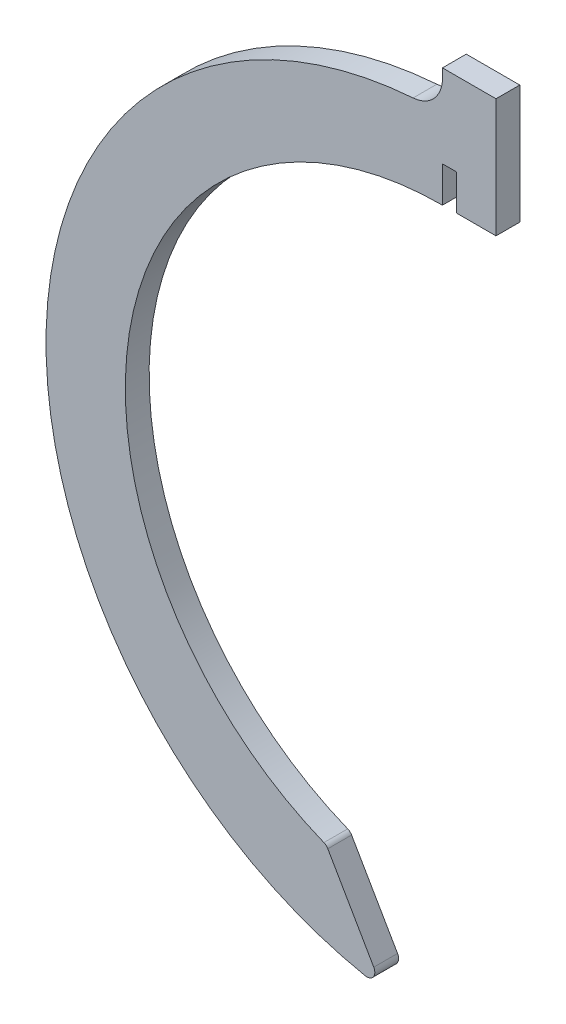
ISO-10303-21;
HEADER;
FILE_DESCRIPTION(('STEP AP214'),'2;1');
FILE_NAME('part.step','',(''),(''),'','','');
FILE_SCHEMA(('AUTOMOTIVE_DESIGN { 1 0 10303 214 1 1 1 1 }'));
ENDSEC;
DATA;
#1=APPLICATION_CONTEXT('core data for automotive mechanical design processes');
#2=APPLICATION_PROTOCOL_DEFINITION('international standard','automotive_design',2000,#1);
#3=PRODUCT_CONTEXT('',#1,'mechanical');
#4=PRODUCT('Part','Part','',(#3));
#5=PRODUCT_RELATED_PRODUCT_CATEGORY('part','',(#4));
#6=PRODUCT_DEFINITION_FORMATION('','',#4);
#7=PRODUCT_DEFINITION_CONTEXT('part definition',#1,'design');
#8=PRODUCT_DEFINITION('design','',#6,#7);
#9=PRODUCT_DEFINITION_SHAPE('','',#8);
#10=(LENGTH_UNIT() NAMED_UNIT(*) SI_UNIT(.MILLI.,.METRE.));
#11=(NAMED_UNIT(*) PLANE_ANGLE_UNIT() SI_UNIT($,.RADIAN.));
#12=(NAMED_UNIT(*) SI_UNIT($,.STERADIAN.) SOLID_ANGLE_UNIT());
#13=UNCERTAINTY_MEASURE_WITH_UNIT(LENGTH_MEASURE(1.E-05),#10,'distance_accuracy_value','');
#14=(GEOMETRIC_REPRESENTATION_CONTEXT(3) GLOBAL_UNCERTAINTY_ASSIGNED_CONTEXT((#13)) GLOBAL_UNIT_ASSIGNED_CONTEXT((#10,
#11,#12)) REPRESENTATION_CONTEXT('',''));
#15=CARTESIAN_POINT('',(0.,0.,0.));
#16=DIRECTION('',(0.,0.,1.));
#17=DIRECTION('',(1.,0.,0.));
#18=AXIS2_PLACEMENT_3D('',#15,#16,#17);
#19=CARTESIAN_POINT('',(0.,0.,3.));
#20=DIRECTION('',(-1.,0.,0.));
#21=DIRECTION('',(0.,0.,1.));
#22=AXIS2_PLACEMENT_3D('',#19,#20,#21);
#23=PLANE('',#22);
#24=DIRECTION('',(0.,1.,0.));
#25=VECTOR('',#24,1.);
#26=CARTESIAN_POINT('',(0.,0.,0.));
#27=LINE('',#26,#25);
#28=CARTESIAN_POINT('',(0.,53.8516480713451,0.));
#29=VERTEX_POINT('',#28);
#30=CARTESIAN_POINT('',(0.,55.,0.));
#31=VERTEX_POINT('',#30);
#32=EDGE_CURVE('E174',#29,#31,#27,.T.);
#33=ORIENTED_EDGE('',*,*,#32,.F.);
#34=DIRECTION('',(0.,0.,-1.));
#35=VECTOR('',#34,1.);
#36=CARTESIAN_POINT('',(0.,53.8516480713451,3.));
#37=LINE('',#36,#35);
#38=CARTESIAN_POINT('',(0.,53.8516480713451,3.));
#39=VERTEX_POINT('',#38);
#40=EDGE_CURVE('E53',#29,#39,#37,.F.);
#41=ORIENTED_EDGE('',*,*,#40,.T.);
#42=DIRECTION('',(0.,1.,0.));
#43=VECTOR('',#42,1.);
#44=CARTESIAN_POINT('',(0.,0.,3.));
#45=LINE('',#44,#43);
#46=CARTESIAN_POINT('',(0.,55.,3.));
#47=VERTEX_POINT('',#46);
#48=EDGE_CURVE('E195',#39,#47,#45,.T.);
#49=ORIENTED_EDGE('',*,*,#48,.T.);
#50=DIRECTION('',(0.,0.,-1.));
#51=VECTOR('',#50,1.);
#52=CARTESIAN_POINT('',(0.,55.,3.));
#53=LINE('',#52,#51);
#54=EDGE_CURVE('E173',#47,#31,#53,.T.);
#55=ORIENTED_EDGE('',*,*,#54,.T.);
#56=EDGE_LOOP('',(#33,#41,#49,#55));
#57=FACE_BOUND('',#56,.T.);
#58=ADVANCED_FACE('F38',(#57),#23,.T.);
#59=CARTESIAN_POINT('',(0.,0.,3.));
#60=DIRECTION('',(0.,0.,-1.));
#61=DIRECTION('',(-1.,0.,0.));
#62=AXIS2_PLACEMENT_3D('',#59,#60,#61);
#63=CYLINDRICAL_SURFACE('',#62,50.);
#64=CARTESIAN_POINT('',(0.,0.,3.));
#65=DIRECTION('',(0.,0.,1.));
#66=DIRECTION('',(1.,0.,0.));
#67=AXIS2_PLACEMENT_3D('',#64,#65,#66);
#68=CIRCLE('',#67,50.);
#69=CARTESIAN_POINT('',(-3.7037037037037,49.8626371030973,3.));
#70=VERTEX_POINT('',#69);
#71=CARTESIAN_POINT('',(-9.72775243810218,-49.0445800522647,3.));
#72=VERTEX_POINT('',#71);
#73=EDGE_CURVE('E159',#70,#72,#68,.T.);
#74=ORIENTED_EDGE('',*,*,#73,.F.);
#75=DIRECTION('',(0.,0.,-1.));
#76=VECTOR('',#75,1.);
#77=CARTESIAN_POINT('',(-3.7037037037037,49.8626371030973,3.));
#78=LINE('',#77,#76);
#79=CARTESIAN_POINT('',(-3.7037037037037,49.8626371030973,0.));
#80=VERTEX_POINT('',#79);
#81=EDGE_CURVE('E228',#70,#80,#78,.T.);
#82=ORIENTED_EDGE('',*,*,#81,.T.);
#83=CARTESIAN_POINT('',(0.,0.,0.));
#84=DIRECTION('',(0.,0.,1.));
#85=DIRECTION('',(1.,0.,0.));
#86=AXIS2_PLACEMENT_3D('',#83,#84,#85);
#87=CIRCLE('',#86,50.);
#88=CARTESIAN_POINT('',(-9.72775243810218,-49.0445800522647,0.));
#89=VERTEX_POINT('',#88);
#90=EDGE_CURVE('E176',#80,#89,#87,.T.);
#91=ORIENTED_EDGE('',*,*,#90,.T.);
#92=DIRECTION('',(0.,0.,-1.));
#93=VECTOR('',#92,1.);
#94=CARTESIAN_POINT('',(-9.72775243810218,-49.0445800522647,3.));
#95=LINE('',#94,#93);
#96=EDGE_CURVE('E215',#89,#72,#95,.F.);
#97=ORIENTED_EDGE('',*,*,#96,.T.);
#98=EDGE_LOOP('',(#74,#82,#91,#97));
#99=FACE_BOUND('',#98,.T.);
#100=ADVANCED_FACE('F234',(#99),#63,.T.);
#101=CARTESIAN_POINT('',(-27.0960602373891,-15.6439176720351,3.));
#102=DIRECTION('',(0.866025403784436,0.500000000000004,0.));
#103=DIRECTION('',(-0.500000000000004,0.866025403784437,0.));
#104=AXIS2_PLACEMENT_3D('',#101,#102,#103);
#105=PLANE('',#104);
#106=DIRECTION('',(0.500000000000004,-0.866025403784436,0.));
#107=VECTOR('',#106,1.);
#108=CARTESIAN_POINT('',(-27.0960602373891,-15.6439176720351,0.));
#109=LINE('',#108,#107);
#110=CARTESIAN_POINT('',(-14.4618241228248,-37.5270565372818,0.));
#111=VERTEX_POINT('',#110);
#112=CARTESIAN_POINT('',(-8.6671719855557,-47.5636884512194,0.));
#113=VERTEX_POINT('',#112);
#114=EDGE_CURVE('E178',#111,#113,#109,.T.);
#115=ORIENTED_EDGE('',*,*,#114,.F.);
#116=DIRECTION('',(0.,0.,-1.));
#117=VECTOR('',#116,1.);
#118=CARTESIAN_POINT('',(-14.4618241228248,-37.5270565372818,3.));
#119=LINE('',#118,#117);
#120=CARTESIAN_POINT('',(-14.4618241228248,-37.5270565372818,3.));
#121=VERTEX_POINT('',#120);
#122=EDGE_CURVE('E225',#111,#121,#119,.F.);
#123=ORIENTED_EDGE('',*,*,#122,.T.);
#124=DIRECTION('',(0.500000000000004,-0.866025403784436,0.));
#125=VECTOR('',#124,1.);
#126=CARTESIAN_POINT('',(-27.0960602373891,-15.6439176720351,3.));
#127=LINE('',#126,#125);
#128=CARTESIAN_POINT('',(-8.6671719855557,-47.5636884512194,3.));
#129=VERTEX_POINT('',#128);
#130=EDGE_CURVE('E157',#121,#129,#127,.T.);
#131=ORIENTED_EDGE('',*,*,#130,.T.);
#132=DIRECTION('',(0.,0.,1.));
#133=VECTOR('',#132,1.);
#134=CARTESIAN_POINT('',(-8.6671719855557,-47.5636884512194,0.));
#135=LINE('',#134,#133);
#136=EDGE_CURVE('E142',#129,#113,#135,.F.);
#137=ORIENTED_EDGE('',*,*,#136,.T.);
#138=EDGE_LOOP('',(#115,#123,#131,#137));
#139=FACE_BOUND('',#138,.T.);
#140=ADVANCED_FACE('F270',(#139),#105,.T.);
#141=CARTESIAN_POINT('',(0.,0.,3.));
#142=DIRECTION('',(0.,0.,-1.));
#143=DIRECTION('',(-1.,0.,0.));
#144=AXIS2_PLACEMENT_3D('',#141,#142,#143);
#145=CYLINDRICAL_SURFACE('',#144,40.);
#146=CARTESIAN_POINT('',(0.,0.,3.));
#147=DIRECTION('',(0.,0.,1.));
#148=DIRECTION('',(1.,0.,0.));
#149=AXIS2_PLACEMENT_3D('',#146,#147,#148);
#150=CIRCLE('',#149,40.);
#151=CARTESIAN_POINT('',(0.,40.,3.));
#152=VERTEX_POINT('',#151);
#153=CARTESIAN_POINT('',(-14.9539995381554,-37.0995673534456,3.));
#154=VERTEX_POINT('',#153);
#155=EDGE_CURVE('E136',#152,#154,#150,.T.);
#156=ORIENTED_EDGE('',*,*,#155,.T.);
#157=DIRECTION('',(0.,0.,-1.));
#158=VECTOR('',#157,1.);
#159=CARTESIAN_POINT('',(-14.9539995381554,-37.0995673534457,3.));
#160=LINE('',#159,#158);
#161=CARTESIAN_POINT('',(-14.9539995381554,-37.0995673534456,0.));
#162=VERTEX_POINT('',#161);
#163=EDGE_CURVE('E221',#154,#162,#160,.T.);
#164=ORIENTED_EDGE('',*,*,#163,.T.);
#165=CARTESIAN_POINT('',(0.,0.,0.));
#166=DIRECTION('',(0.,0.,1.));
#167=DIRECTION('',(1.,0.,0.));
#168=AXIS2_PLACEMENT_3D('',#165,#166,#167);
#169=CIRCLE('',#168,40.);
#170=CARTESIAN_POINT('',(0.,40.,0.));
#171=VERTEX_POINT('',#170);
#172=EDGE_CURVE('E139',#171,#162,#169,.T.);
#173=ORIENTED_EDGE('',*,*,#172,.F.);
#174=DIRECTION('',(0.,0.,-1.));
#175=VECTOR('',#174,1.);
#176=CARTESIAN_POINT('',(0.,40.,3.));
#177=LINE('',#176,#175);
#178=EDGE_CURVE('E131',#152,#171,#177,.T.);
#179=ORIENTED_EDGE('',*,*,#178,.F.);
#180=EDGE_LOOP('',(#156,#164,#173,#179));
#181=FACE_BOUND('',#180,.T.);
#182=ADVANCED_FACE('F133',(#181),#145,.F.);
#183=CARTESIAN_POINT('',(0.,0.,3.));
#184=DIRECTION('',(-1.,0.,0.));
#185=DIRECTION('',(0.,0.,1.));
#186=AXIS2_PLACEMENT_3D('',#183,#184,#185);
#187=PLANE('',#186);
#188=DIRECTION('',(0.,1.,0.));
#189=VECTOR('',#188,1.);
#190=CARTESIAN_POINT('',(0.,0.,0.));
#191=LINE('',#190,#189);
#192=CARTESIAN_POINT('',(0.,44.5184182434861,0.));
#193=VERTEX_POINT('',#192);
#194=EDGE_CURVE('E181',#171,#193,#191,.T.);
#195=ORIENTED_EDGE('',*,*,#194,.T.);
#196=DIRECTION('',(0.,0.,-1.));
#197=VECTOR('',#196,1.);
#198=CARTESIAN_POINT('',(0.,44.5184182434861,3.));
#199=LINE('',#198,#197);
#200=CARTESIAN_POINT('',(0.,44.5184182434861,3.));
#201=VERTEX_POINT('',#200);
#202=EDGE_CURVE('E143',#201,#193,#199,.T.);
#203=ORIENTED_EDGE('',*,*,#202,.F.);
#204=DIRECTION('',(0.,1.,0.));
#205=VECTOR('',#204,1.);
#206=CARTESIAN_POINT('',(0.,0.,3.));
#207=LINE('',#206,#205);
#208=EDGE_CURVE('E146',#152,#201,#207,.T.);
#209=ORIENTED_EDGE('',*,*,#208,.F.);
#210=ORIENTED_EDGE('',*,*,#178,.T.);
#211=EDGE_LOOP('',(#195,#203,#209,#210));
#212=FACE_BOUND('',#211,.T.);
#213=ADVANCED_FACE('F147',(#212),#187,.F.);
#214=CARTESIAN_POINT('',(0.,44.5184182434861,3.));
#215=DIRECTION('',(0.,1.,0.));
#216=DIRECTION('',(0.,0.,1.));
#217=AXIS2_PLACEMENT_3D('',#214,#215,#216);
#218=PLANE('',#217);
#219=DIRECTION('',(1.,0.,0.));
#220=VECTOR('',#219,1.);
#221=CARTESIAN_POINT('',(0.,44.5184182434861,0.));
#222=LINE('',#221,#220);
#223=CARTESIAN_POINT('',(1.79,44.5184182434861,0.));
#224=VERTEX_POINT('',#223);
#225=EDGE_CURVE('E183',#193,#224,#222,.T.);
#226=ORIENTED_EDGE('',*,*,#225,.T.);
#227=DIRECTION('',(0.,0.,-1.));
#228=VECTOR('',#227,1.);
#229=CARTESIAN_POINT('',(1.79,44.5184182434861,3.));
#230=LINE('',#229,#228);
#231=CARTESIAN_POINT('',(1.79,44.5184182434861,3.));
#232=VERTEX_POINT('',#231);
#233=EDGE_CURVE('E206',#232,#224,#230,.T.);
#234=ORIENTED_EDGE('',*,*,#233,.F.);
#235=DIRECTION('',(1.,0.,0.));
#236=VECTOR('',#235,1.);
#237=CARTESIAN_POINT('',(0.,44.5184182434861,3.));
#238=LINE('',#237,#236);
#239=EDGE_CURVE('E151',#201,#232,#238,.T.);
#240=ORIENTED_EDGE('',*,*,#239,.F.);
#241=ORIENTED_EDGE('',*,*,#202,.T.);
#242=EDGE_LOOP('',(#226,#234,#240,#241));
#243=FACE_BOUND('',#242,.T.);
#244=ADVANCED_FACE('F295',(#243),#218,.F.);
#245=CARTESIAN_POINT('',(1.79000000000001,0.,3.));
#246=DIRECTION('',(1.,0.,0.));
#247=DIRECTION('',(0.,1.,0.));
#248=AXIS2_PLACEMENT_3D('',#245,#246,#247);
#249=PLANE('',#248);
#250=DIRECTION('',(0.,-1.,0.));
#251=VECTOR('',#250,1.);
#252=CARTESIAN_POINT('',(1.79000000000001,0.,0.));
#253=LINE('',#252,#251);
#254=CARTESIAN_POINT('',(1.79,40.02,0.));
#255=VERTEX_POINT('',#254);
#256=EDGE_CURVE('E185',#224,#255,#253,.T.);
#257=ORIENTED_EDGE('',*,*,#256,.T.);
#258=DIRECTION('',(0.,0.,-1.));
#259=VECTOR('',#258,1.);
#260=CARTESIAN_POINT('',(1.79,40.02,3.));
#261=LINE('',#260,#259);
#262=CARTESIAN_POINT('',(1.79,40.02,3.));
#263=VERTEX_POINT('',#262);
#264=EDGE_CURVE('E203',#263,#255,#261,.T.);
#265=ORIENTED_EDGE('',*,*,#264,.F.);
#266=DIRECTION('',(0.,-1.,0.));
#267=VECTOR('',#266,1.);
#268=CARTESIAN_POINT('',(1.79000000000001,0.,3.));
#269=LINE('',#268,#267);
#270=EDGE_CURVE('E164',#232,#263,#269,.T.);
#271=ORIENTED_EDGE('',*,*,#270,.F.);
#272=ORIENTED_EDGE('',*,*,#233,.T.);
#273=EDGE_LOOP('',(#257,#265,#271,#272));
#274=FACE_BOUND('',#273,.T.);
#275=ADVANCED_FACE('F291',(#274),#249,.F.);
#276=CARTESIAN_POINT('',(0.,40.02,3.));
#277=DIRECTION('',(0.,1.,0.));
#278=DIRECTION('',(0.,0.,1.));
#279=AXIS2_PLACEMENT_3D('',#276,#277,#278);
#280=PLANE('',#279);
#281=DIRECTION('',(1.,0.,0.));
#282=VECTOR('',#281,1.);
#283=CARTESIAN_POINT('',(0.,40.02,0.));
#284=LINE('',#283,#282);
#285=CARTESIAN_POINT('',(6.75,40.02,0.));
#286=VERTEX_POINT('',#285);
#287=EDGE_CURVE('E187',#255,#286,#284,.T.);
#288=ORIENTED_EDGE('',*,*,#287,.T.);
#289=DIRECTION('',(0.,0.,-1.));
#290=VECTOR('',#289,1.);
#291=CARTESIAN_POINT('',(6.75,40.02,3.));
#292=LINE('',#291,#290);
#293=CARTESIAN_POINT('',(6.75,40.02,3.));
#294=VERTEX_POINT('',#293);
#295=EDGE_CURVE('E200',#294,#286,#292,.T.);
#296=ORIENTED_EDGE('',*,*,#295,.F.);
#297=DIRECTION('',(1.,0.,0.));
#298=VECTOR('',#297,1.);
#299=CARTESIAN_POINT('',(0.,40.02,3.));
#300=LINE('',#299,#298);
#301=EDGE_CURVE('E166',#263,#294,#300,.T.);
#302=ORIENTED_EDGE('',*,*,#301,.F.);
#303=ORIENTED_EDGE('',*,*,#264,.T.);
#304=EDGE_LOOP('',(#288,#296,#302,#303));
#305=FACE_BOUND('',#304,.T.);
#306=ADVANCED_FACE('F288',(#305),#280,.F.);
#307=CARTESIAN_POINT('',(6.75,0.,3.));
#308=DIRECTION('',(-1.,0.,0.));
#309=DIRECTION('',(0.,0.,1.));
#310=AXIS2_PLACEMENT_3D('',#307,#308,#309);
#311=PLANE('',#310);
#312=DIRECTION('',(0.,1.,0.));
#313=VECTOR('',#312,1.);
#314=CARTESIAN_POINT('',(6.75,0.,0.));
#315=LINE('',#314,#313);
#316=CARTESIAN_POINT('',(6.75,55.,0.));
#317=VERTEX_POINT('',#316);
#318=EDGE_CURVE('E189',#286,#317,#315,.T.);
#319=ORIENTED_EDGE('',*,*,#318,.T.);
#320=DIRECTION('',(0.,0.,-1.));
#321=VECTOR('',#320,1.);
#322=CARTESIAN_POINT('',(6.75,55.,3.));
#323=LINE('',#322,#321);
#324=CARTESIAN_POINT('',(6.75,55.,3.));
#325=VERTEX_POINT('',#324);
#326=EDGE_CURVE('E198',#325,#317,#323,.T.);
#327=ORIENTED_EDGE('',*,*,#326,.F.);
#328=DIRECTION('',(0.,1.,0.));
#329=VECTOR('',#328,1.);
#330=CARTESIAN_POINT('',(6.75,0.,3.));
#331=LINE('',#330,#329);
#332=EDGE_CURVE('E168',#294,#325,#331,.T.);
#333=ORIENTED_EDGE('',*,*,#332,.F.);
#334=ORIENTED_EDGE('',*,*,#295,.T.);
#335=EDGE_LOOP('',(#319,#327,#333,#334));
#336=FACE_BOUND('',#335,.T.);
#337=ADVANCED_FACE('F256',(#336),#311,.F.);
#338=CARTESIAN_POINT('',(0.,55.,3.));
#339=DIRECTION('',(0.,1.,0.));
#340=DIRECTION('',(0.,0.,1.));
#341=AXIS2_PLACEMENT_3D('',#338,#339,#340);
#342=PLANE('',#341);
#343=DIRECTION('',(1.,0.,0.));
#344=VECTOR('',#343,1.);
#345=CARTESIAN_POINT('',(0.,55.,0.));
#346=LINE('',#345,#344);
#347=EDGE_CURVE('E192',#31,#317,#346,.T.);
#348=ORIENTED_EDGE('',*,*,#347,.F.);
#349=ORIENTED_EDGE('',*,*,#54,.F.);
#350=DIRECTION('',(1.,0.,0.));
#351=VECTOR('',#350,1.);
#352=CARTESIAN_POINT('',(0.,55.,3.));
#353=LINE('',#352,#351);
#354=EDGE_CURVE('E170',#47,#325,#353,.T.);
#355=ORIENTED_EDGE('',*,*,#354,.T.);
#356=ORIENTED_EDGE('',*,*,#326,.T.);
#357=EDGE_LOOP('',(#348,#349,#355,#356));
#358=FACE_BOUND('',#357,.T.);
#359=ADVANCED_FACE('F250',(#358),#342,.T.);
#360=CARTESIAN_POINT('',(0.,0.,3.));
#361=DIRECTION('',(0.,0.,1.));
#362=DIRECTION('',(1.,0.,0.));
#363=AXIS2_PLACEMENT_3D('',#360,#361,#362);
#364=PLANE('',#363);
#365=ORIENTED_EDGE('',*,*,#130,.F.);
#366=CARTESIAN_POINT('',(-15.3278495266093,-38.0270565372818,3.));
#367=DIRECTION('',(0.,0.,1.));
#368=DIRECTION('',(1.,0.,0.));
#369=AXIS2_PLACEMENT_3D('',#366,#367,#368);
#370=CIRCLE('',#369,1.);
#371=EDGE_CURVE('E156',#121,#154,#370,.T.);
#372=ORIENTED_EDGE('',*,*,#371,.T.);
#373=ORIENTED_EDGE('',*,*,#155,.F.);
#374=ORIENTED_EDGE('',*,*,#208,.T.);
#375=ORIENTED_EDGE('',*,*,#239,.T.);
#376=ORIENTED_EDGE('',*,*,#270,.T.);
#377=ORIENTED_EDGE('',*,*,#301,.T.);
#378=ORIENTED_EDGE('',*,*,#332,.T.);
#379=ORIENTED_EDGE('',*,*,#354,.F.);
#380=ORIENTED_EDGE('',*,*,#48,.F.);
#381=CARTESIAN_POINT('',(-4.,53.8516480713451,3.));
#382=DIRECTION('',(0.,0.,1.));
#383=DIRECTION('',(1.,0.,0.));
#384=AXIS2_PLACEMENT_3D('',#381,#382,#383);
#385=CIRCLE('',#384,4.);
#386=EDGE_CURVE('E11',#39,#70,#385,.F.);
#387=ORIENTED_EDGE('',*,*,#386,.T.);
#388=ORIENTED_EDGE('',*,*,#73,.T.);
#389=CARTESIAN_POINT('',(-9.53319738934014,-48.0636884512194,3.));
#390=DIRECTION('',(0.,0.,1.));
#391=DIRECTION('',(1.,0.,0.));
#392=AXIS2_PLACEMENT_3D('',#389,#390,#391);
#393=CIRCLE('',#392,1.);
#394=EDGE_CURVE('E218',#72,#129,#393,.T.);
#395=ORIENTED_EDGE('',*,*,#394,.T.);
#396=EDGE_LOOP('',(#365,#372,#373,#374,#375,#376,#377,#378,#379,#380,#387,#388,#395));
#397=FACE_BOUND('',#396,.T.);
#398=ADVANCED_FACE('F154',(#397),#364,.T.);
#399=CARTESIAN_POINT('',(0.,0.,0.));
#400=DIRECTION('',(0.,0.,1.));
#401=DIRECTION('',(1.,0.,0.));
#402=AXIS2_PLACEMENT_3D('',#399,#400,#401);
#403=PLANE('',#402);
#404=ORIENTED_EDGE('',*,*,#172,.T.);
#405=CARTESIAN_POINT('',(-15.3278495266093,-38.0270565372818,0.));
#406=DIRECTION('',(0.,0.,1.));
#407=DIRECTION('',(1.,0.,0.));
#408=AXIS2_PLACEMENT_3D('',#405,#406,#407);
#409=CIRCLE('',#408,1.);
#410=EDGE_CURVE('E223',#162,#111,#409,.F.);
#411=ORIENTED_EDGE('',*,*,#410,.T.);
#412=ORIENTED_EDGE('',*,*,#114,.T.);
#413=CARTESIAN_POINT('',(-9.53319738934014,-48.0636884512194,0.));
#414=DIRECTION('',(0.,0.,1.));
#415=DIRECTION('',(1.,0.,0.));
#416=AXIS2_PLACEMENT_3D('',#413,#414,#415);
#417=CIRCLE('',#416,1.);
#418=EDGE_CURVE('E212',#113,#89,#417,.F.);
#419=ORIENTED_EDGE('',*,*,#418,.T.);
#420=ORIENTED_EDGE('',*,*,#90,.F.);
#421=CARTESIAN_POINT('',(-4.,53.8516480713451,0.));
#422=DIRECTION('',(0.,0.,1.));
#423=DIRECTION('',(1.,0.,0.));
#424=AXIS2_PLACEMENT_3D('',#421,#422,#423);
#425=CIRCLE('',#424,4.);
#426=EDGE_CURVE('E46',#80,#29,#425,.T.);
#427=ORIENTED_EDGE('',*,*,#426,.T.);
#428=ORIENTED_EDGE('',*,*,#32,.T.);
#429=ORIENTED_EDGE('',*,*,#347,.T.);
#430=ORIENTED_EDGE('',*,*,#318,.F.);
#431=ORIENTED_EDGE('',*,*,#287,.F.);
#432=ORIENTED_EDGE('',*,*,#256,.F.);
#433=ORIENTED_EDGE('',*,*,#225,.F.);
#434=ORIENTED_EDGE('',*,*,#194,.F.);
#435=EDGE_LOOP('',(#404,#411,#412,#419,#420,#427,#428,#429,#430,#431,#432,#433,#434));
#436=FACE_BOUND('',#435,.T.);
#437=ADVANCED_FACE('F237',(#436),#403,.F.);
#438=CARTESIAN_POINT('',(-9.53319738934014,-48.0636884512194,3.));
#439=DIRECTION('',(0.,0.,-1.));
#440=DIRECTION('',(-1.,0.,0.));
#441=AXIS2_PLACEMENT_3D('',#438,#439,#440);
#442=CYLINDRICAL_SURFACE('',#441,1.);
#443=ORIENTED_EDGE('',*,*,#394,.F.);
#444=ORIENTED_EDGE('',*,*,#96,.F.);
#445=ORIENTED_EDGE('',*,*,#418,.F.);
#446=ORIENTED_EDGE('',*,*,#136,.F.);
#447=EDGE_LOOP('',(#443,#444,#445,#446));
#448=FACE_BOUND('',#447,.T.);
#449=ADVANCED_FACE('F244',(#448),#442,.T.);
#450=CARTESIAN_POINT('',(-15.3278495266093,-38.0270565372818,3.));
#451=DIRECTION('',(0.,0.,-1.));
#452=DIRECTION('',(-1.,0.,0.));
#453=AXIS2_PLACEMENT_3D('',#450,#451,#452);
#454=CYLINDRICAL_SURFACE('',#453,1.);
#455=ORIENTED_EDGE('',*,*,#371,.F.);
#456=ORIENTED_EDGE('',*,*,#122,.F.);
#457=ORIENTED_EDGE('',*,*,#410,.F.);
#458=ORIENTED_EDGE('',*,*,#163,.F.);
#459=EDGE_LOOP('',(#455,#456,#457,#458));
#460=FACE_BOUND('',#459,.T.);
#461=ADVANCED_FACE('F260',(#460),#454,.T.);
#462=CARTESIAN_POINT('',(-4.,53.8516480713451,3.));
#463=DIRECTION('',(0.,0.,-1.));
#464=DIRECTION('',(-1.,0.,0.));
#465=AXIS2_PLACEMENT_3D('',#462,#463,#464);
#466=CYLINDRICAL_SURFACE('',#465,4.);
#467=ORIENTED_EDGE('',*,*,#386,.F.);
#468=ORIENTED_EDGE('',*,*,#40,.F.);
#469=ORIENTED_EDGE('',*,*,#426,.F.);
#470=ORIENTED_EDGE('',*,*,#81,.F.);
#471=EDGE_LOOP('',(#467,#468,#469,#470));
#472=FACE_BOUND('',#471,.T.);
#473=ADVANCED_FACE('F40',(#472),#466,.F.);
#474=CLOSED_SHELL('',(#58,#100,#140,#182,#213,#244,#275,#306,#337,#359,#398,#437,#449,#461,#473));
#475=MANIFOLD_SOLID_BREP('B2',#474);
#476=ADVANCED_BREP_SHAPE_REPRESENTATION('',(#18,#475),#14);
#477=SHAPE_DEFINITION_REPRESENTATION(#9,#476);
ENDSEC;
END-ISO-10303-21;
